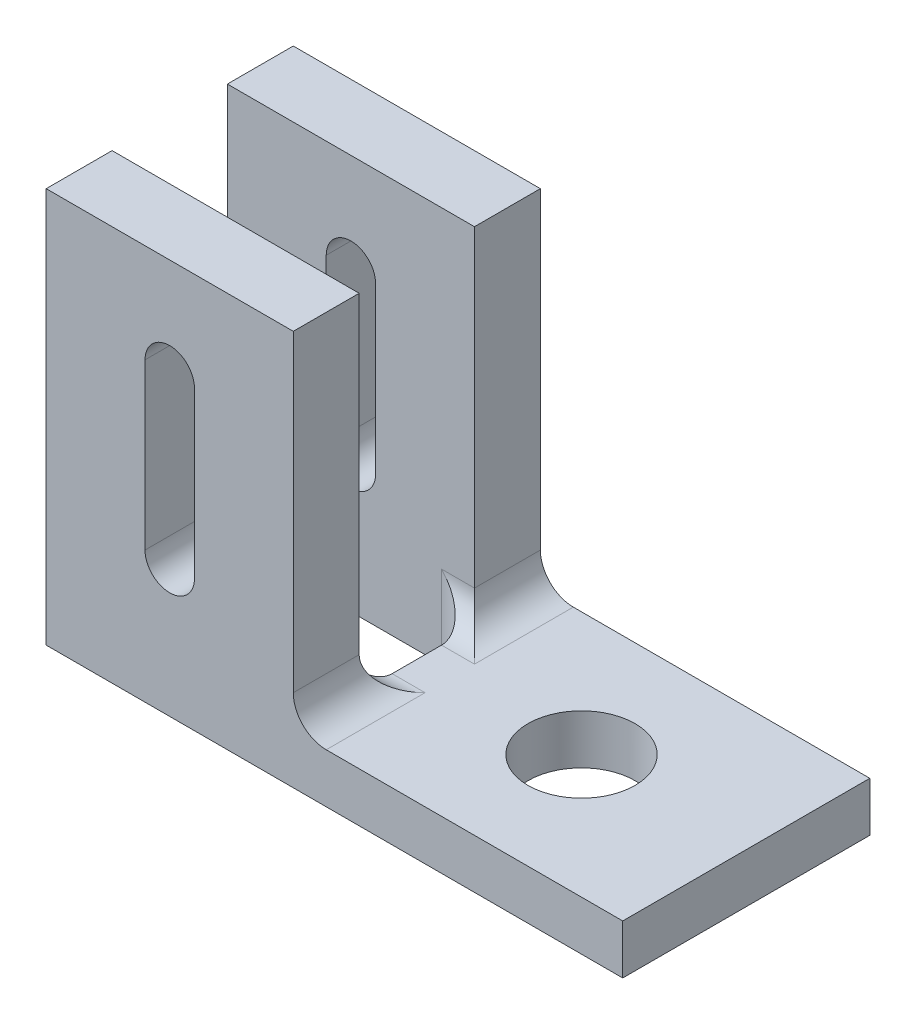
ISO-10303-21;
HEADER;
FILE_DESCRIPTION(('STEP AP214'),'2;1');
FILE_NAME('part.step','',(''),(''),'','','');
FILE_SCHEMA(('AUTOMOTIVE_DESIGN { 1 0 10303 214 1 1 1 1 }'));
ENDSEC;
DATA;
#1=APPLICATION_CONTEXT('core data for automotive mechanical design processes');
#2=APPLICATION_PROTOCOL_DEFINITION('international standard','automotive_design',2000,#1);
#3=PRODUCT_CONTEXT('',#1,'mechanical');
#4=PRODUCT('Part','Part','',(#3));
#5=PRODUCT_RELATED_PRODUCT_CATEGORY('part','',(#4));
#6=PRODUCT_DEFINITION_FORMATION('','',#4);
#7=PRODUCT_DEFINITION_CONTEXT('part definition',#1,'design');
#8=PRODUCT_DEFINITION('design','',#6,#7);
#9=PRODUCT_DEFINITION_SHAPE('','',#8);
#10=(LENGTH_UNIT() NAMED_UNIT(*) SI_UNIT(.MILLI.,.METRE.));
#11=(NAMED_UNIT(*) PLANE_ANGLE_UNIT() SI_UNIT($,.RADIAN.));
#12=(NAMED_UNIT(*) SI_UNIT($,.STERADIAN.) SOLID_ANGLE_UNIT());
#13=UNCERTAINTY_MEASURE_WITH_UNIT(LENGTH_MEASURE(1.E-05),#10,'distance_accuracy_value','');
#14=(GEOMETRIC_REPRESENTATION_CONTEXT(3) GLOBAL_UNCERTAINTY_ASSIGNED_CONTEXT((#13)) GLOBAL_UNIT_ASSIGNED_CONTEXT((#10,
#11,#12)) REPRESENTATION_CONTEXT('',''));
#15=CARTESIAN_POINT('',(0.,0.,0.));
#16=DIRECTION('',(0.,0.,1.));
#17=DIRECTION('',(1.,0.,0.));
#18=AXIS2_PLACEMENT_3D('',#15,#16,#17);
#19=CARTESIAN_POINT('',(-3.25798973217916,24.8389409904563,15.));
#20=DIRECTION('',(-1.,0.,0.));
#21=DIRECTION('',(0.,-1.,0.));
#22=AXIS2_PLACEMENT_3D('',#19,#20,#21);
#23=PLANE('',#22);
#24=DIRECTION('',(0.,1.,0.));
#25=VECTOR('',#24,1.);
#26=CARTESIAN_POINT('',(-3.25798973217916,24.8389409904563,15.));
#27=LINE('',#26,#25);
#28=CARTESIAN_POINT('',(-3.25798973217916,5.83894099045628,15.));
#29=VERTEX_POINT('',#28);
#30=CARTESIAN_POINT('',(-3.25798973217916,24.8389409904563,15.));
#31=VERTEX_POINT('',#30);
#32=EDGE_CURVE('E305',#29,#31,#27,.T.);
#33=ORIENTED_EDGE('',*,*,#32,.F.);
#34=DIRECTION('',(0.,0.,-1.));
#35=VECTOR('',#34,1.);
#36=CARTESIAN_POINT('',(-3.25798973217916,5.83894099045627,11.));
#37=LINE('',#36,#35);
#38=CARTESIAN_POINT('',(-3.25798973217916,5.83894099045627,11.));
#39=VERTEX_POINT('',#38);
#40=EDGE_CURVE('E273',#29,#39,#37,.T.);
#41=ORIENTED_EDGE('',*,*,#40,.T.);
#42=DIRECTION('',(0.,-1.,0.));
#43=VECTOR('',#42,1.);
#44=CARTESIAN_POINT('',(-3.25798973217917,24.8389409904563,11.));
#45=LINE('',#44,#43);
#46=CARTESIAN_POINT('',(-3.25798973217917,24.8389409904563,11.));
#47=VERTEX_POINT('',#46);
#48=EDGE_CURVE('E209',#47,#39,#45,.T.);
#49=ORIENTED_EDGE('',*,*,#48,.F.);
#50=DIRECTION('',(0.,0.,-1.));
#51=VECTOR('',#50,1.);
#52=CARTESIAN_POINT('',(-3.25798973217916,24.8389409904563,15.));
#53=LINE('',#52,#51);
#54=EDGE_CURVE('E225',#31,#47,#53,.T.);
#55=ORIENTED_EDGE('',*,*,#54,.F.);
#56=EDGE_LOOP('',(#33,#41,#49,#55));
#57=FACE_BOUND('',#56,.T.);
#58=ADVANCED_FACE('F35',(#57),#23,.F.);
#59=CARTESIAN_POINT('',(-18.2579897321792,24.8389409904563,15.));
#60=DIRECTION('',(0.,-1.,0.));
#61=DIRECTION('',(1.,0.,0.));
#62=AXIS2_PLACEMENT_3D('',#59,#60,#61);
#63=PLANE('',#62);
#64=ORIENTED_EDGE('',*,*,#54,.T.);
#65=DIRECTION('',(1.,0.,0.));
#66=VECTOR('',#65,1.);
#67=CARTESIAN_POINT('',(-18.2579897321792,24.8389409904563,11.));
#68=LINE('',#67,#66);
#69=CARTESIAN_POINT('',(-18.2579897321792,24.8389409904563,11.));
#70=VERTEX_POINT('',#69);
#71=EDGE_CURVE('E219',#70,#47,#68,.T.);
#72=ORIENTED_EDGE('',*,*,#71,.F.);
#73=DIRECTION('',(0.,0.,-1.));
#74=VECTOR('',#73,1.);
#75=CARTESIAN_POINT('',(-18.2579897321792,24.8389409904563,15.));
#76=LINE('',#75,#74);
#77=CARTESIAN_POINT('',(-18.2579897321792,24.8389409904563,15.));
#78=VERTEX_POINT('',#77);
#79=EDGE_CURVE('E226',#78,#70,#76,.T.);
#80=ORIENTED_EDGE('',*,*,#79,.F.);
#81=DIRECTION('',(-1.,0.,0.));
#82=VECTOR('',#81,1.);
#83=CARTESIAN_POINT('',(-18.2579897321792,24.8389409904563,15.));
#84=LINE('',#83,#82);
#85=EDGE_CURVE('E386',#31,#78,#84,.T.);
#86=ORIENTED_EDGE('',*,*,#85,.F.);
#87=EDGE_LOOP('',(#64,#72,#80,#86));
#88=FACE_BOUND('',#87,.T.);
#89=ADVANCED_FACE('F435',(#88),#63,.F.);
#90=CARTESIAN_POINT('',(-18.2579897321792,24.8389409904563,15.));
#91=DIRECTION('',(1.,0.,0.));
#92=DIRECTION('',(0.,1.,0.));
#93=AXIS2_PLACEMENT_3D('',#90,#91,#92);
#94=PLANE('',#93);
#95=DIRECTION('',(0.,0.,-1.));
#96=VECTOR('',#95,1.);
#97=CARTESIAN_POINT('',(-18.2579897321792,0.838940990456269,15.));
#98=LINE('',#97,#96);
#99=CARTESIAN_POINT('',(-18.2579897321792,0.838940990456269,4.));
#100=VERTEX_POINT('',#99);
#101=CARTESIAN_POINT('',(-18.2579897321792,0.838940990456269,0.));
#102=VERTEX_POINT('',#101);
#103=EDGE_CURVE('E239',#100,#102,#98,.T.);
#104=ORIENTED_EDGE('',*,*,#103,.F.);
#105=DIRECTION('',(0.,1.,0.));
#106=VECTOR('',#105,1.);
#107=CARTESIAN_POINT('',(-18.2579897321792,-12.1610590095437,4.));
#108=LINE('',#107,#106);
#109=CARTESIAN_POINT('',(-18.2579897321792,24.8389409904563,4.));
#110=VERTEX_POINT('',#109);
#111=EDGE_CURVE('E312',#100,#110,#108,.T.);
#112=ORIENTED_EDGE('',*,*,#111,.T.);
#113=CARTESIAN_POINT('',(-18.2579897321792,24.8389409904563,0.));
#114=VERTEX_POINT('',#113);
#115=EDGE_CURVE('E218',#110,#114,#76,.T.);
#116=ORIENTED_EDGE('',*,*,#115,.T.);
#117=DIRECTION('',(0.,-1.,0.));
#118=VECTOR('',#117,1.);
#119=CARTESIAN_POINT('',(-18.2579897321792,24.8389409904563,0.));
#120=LINE('',#119,#118);
#121=EDGE_CURVE('E373',#114,#102,#120,.T.);
#122=ORIENTED_EDGE('',*,*,#121,.T.);
#123=EDGE_LOOP('',(#104,#112,#116,#122));
#124=FACE_BOUND('',#123,.T.);
#125=ADVANCED_FACE('F405',(#124),#94,.F.);
#126=CARTESIAN_POINT('',(-10.7579897321792,18.8389409904563,15.));
#127=DIRECTION('',(0.,0.,-1.));
#128=DIRECTION('',(-1.,0.,0.));
#129=AXIS2_PLACEMENT_3D('',#126,#127,#128);
#130=CYLINDRICAL_SURFACE('',#129,1.5);
#131=CARTESIAN_POINT('',(-10.7579897321792,18.8389409904563,4.));
#132=DIRECTION('',(0.,0.,-1.));
#133=DIRECTION('',(-1.,0.,0.));
#134=AXIS2_PLACEMENT_3D('',#131,#132,#133);
#135=CIRCLE('',#134,1.5);
#136=CARTESIAN_POINT('',(-12.2579897321792,18.8389409904563,4.));
#137=VERTEX_POINT('',#136);
#138=CARTESIAN_POINT('',(-9.25798973217916,18.8389409904563,4.));
#139=VERTEX_POINT('',#138);
#140=EDGE_CURVE('E331',#137,#139,#135,.T.);
#141=ORIENTED_EDGE('',*,*,#140,.F.);
#142=DIRECTION('',(0.,0.,-1.));
#143=VECTOR('',#142,1.);
#144=CARTESIAN_POINT('',(-12.2579897321792,18.8389409904563,15.));
#145=LINE('',#144,#143);
#146=CARTESIAN_POINT('',(-12.2579897321792,18.8389409904563,0.));
#147=VERTEX_POINT('',#146);
#148=EDGE_CURVE('E369',#137,#147,#145,.T.);
#149=ORIENTED_EDGE('',*,*,#148,.T.);
#150=CARTESIAN_POINT('',(-10.7579897321792,18.8389409904563,0.));
#151=DIRECTION('',(0.,0.,1.));
#152=DIRECTION('',(1.,0.,0.));
#153=AXIS2_PLACEMENT_3D('',#150,#151,#152);
#154=CIRCLE('',#153,1.5);
#155=CARTESIAN_POINT('',(-9.25798973217916,18.8389409904563,0.));
#156=VERTEX_POINT('',#155);
#157=EDGE_CURVE('E336',#156,#147,#154,.T.);
#158=ORIENTED_EDGE('',*,*,#157,.F.);
#159=DIRECTION('',(0.,0.,-1.));
#160=VECTOR('',#159,1.);
#161=CARTESIAN_POINT('',(-9.25798973217916,18.8389409904563,15.));
#162=LINE('',#161,#160);
#163=EDGE_CURVE('E347',#139,#156,#162,.T.);
#164=ORIENTED_EDGE('',*,*,#163,.F.);
#165=EDGE_LOOP('',(#141,#149,#158,#164));
#166=FACE_BOUND('',#165,.T.);
#167=ADVANCED_FACE('F442',(#166),#130,.F.);
#168=CARTESIAN_POINT('',(-12.2579897321792,18.8389409904563,15.));
#169=DIRECTION('',(1.,0.,0.));
#170=DIRECTION('',(0.,1.,0.));
#171=AXIS2_PLACEMENT_3D('',#168,#169,#170);
#172=PLANE('',#171);
#173=DIRECTION('',(0.,1.,0.));
#174=VECTOR('',#173,1.);
#175=CARTESIAN_POINT('',(-12.2579897321792,18.8389409904563,4.));
#176=LINE('',#175,#174);
#177=CARTESIAN_POINT('',(-12.2579897321792,8.83894099045627,4.));
#178=VERTEX_POINT('',#177);
#179=EDGE_CURVE('E329',#178,#137,#176,.T.);
#180=ORIENTED_EDGE('',*,*,#179,.F.);
#181=DIRECTION('',(0.,0.,-1.));
#182=VECTOR('',#181,1.);
#183=CARTESIAN_POINT('',(-12.2579897321792,8.83894099045627,15.));
#184=LINE('',#183,#182);
#185=CARTESIAN_POINT('',(-12.2579897321792,8.83894099045627,0.));
#186=VERTEX_POINT('',#185);
#187=EDGE_CURVE('E365',#178,#186,#184,.T.);
#188=ORIENTED_EDGE('',*,*,#187,.T.);
#189=DIRECTION('',(0.,-1.,0.));
#190=VECTOR('',#189,1.);
#191=CARTESIAN_POINT('',(-12.2579897321792,18.8389409904563,0.));
#192=LINE('',#191,#190);
#193=EDGE_CURVE('E350',#147,#186,#192,.T.);
#194=ORIENTED_EDGE('',*,*,#193,.F.);
#195=ORIENTED_EDGE('',*,*,#148,.F.);
#196=EDGE_LOOP('',(#180,#188,#194,#195));
#197=FACE_BOUND('',#196,.T.);
#198=ADVANCED_FACE('F551',(#197),#172,.T.);
#199=CARTESIAN_POINT('',(-10.7579897321792,8.83894099045627,15.));
#200=DIRECTION('',(0.,0.,-1.));
#201=DIRECTION('',(-1.,0.,0.));
#202=AXIS2_PLACEMENT_3D('',#199,#200,#201);
#203=CYLINDRICAL_SURFACE('',#202,1.5);
#204=CARTESIAN_POINT('',(-10.7579897321792,8.83894099045627,4.));
#205=DIRECTION('',(0.,0.,-1.));
#206=DIRECTION('',(-1.,0.,0.));
#207=AXIS2_PLACEMENT_3D('',#204,#205,#206);
#208=CIRCLE('',#207,1.5);
#209=CARTESIAN_POINT('',(-9.25798973217916,8.83894099045627,4.));
#210=VERTEX_POINT('',#209);
#211=EDGE_CURVE('E327',#210,#178,#208,.T.);
#212=ORIENTED_EDGE('',*,*,#211,.F.);
#213=DIRECTION('',(0.,0.,-1.));
#214=VECTOR('',#213,1.);
#215=CARTESIAN_POINT('',(-9.25798973217916,8.83894099045627,15.));
#216=LINE('',#215,#214);
#217=CARTESIAN_POINT('',(-9.25798973217916,8.83894099045627,0.));
#218=VERTEX_POINT('',#217);
#219=EDGE_CURVE('E361',#210,#218,#216,.T.);
#220=ORIENTED_EDGE('',*,*,#219,.T.);
#221=CARTESIAN_POINT('',(-10.7579897321792,8.83894099045627,0.));
#222=DIRECTION('',(0.,0.,1.));
#223=DIRECTION('',(1.,0.,0.));
#224=AXIS2_PLACEMENT_3D('',#221,#222,#223);
#225=CIRCLE('',#224,1.5);
#226=EDGE_CURVE('E353',#186,#218,#225,.T.);
#227=ORIENTED_EDGE('',*,*,#226,.F.);
#228=ORIENTED_EDGE('',*,*,#187,.F.);
#229=EDGE_LOOP('',(#212,#220,#227,#228));
#230=FACE_BOUND('',#229,.T.);
#231=ADVANCED_FACE('F544',(#230),#203,.F.);
#232=CARTESIAN_POINT('',(-9.25798973217916,8.83894099045627,15.));
#233=DIRECTION('',(-1.,0.,0.));
#234=DIRECTION('',(0.,0.,1.));
#235=AXIS2_PLACEMENT_3D('',#232,#233,#234);
#236=PLANE('',#235);
#237=DIRECTION('',(0.,-1.,0.));
#238=VECTOR('',#237,1.);
#239=CARTESIAN_POINT('',(-9.25798973217916,8.83894099045627,4.));
#240=LINE('',#239,#238);
#241=EDGE_CURVE('E245',#139,#210,#240,.T.);
#242=ORIENTED_EDGE('',*,*,#241,.F.);
#243=ORIENTED_EDGE('',*,*,#163,.T.);
#244=DIRECTION('',(0.,1.,0.));
#245=VECTOR('',#244,1.);
#246=CARTESIAN_POINT('',(-9.25798973217916,8.83894099045627,0.));
#247=LINE('',#246,#245);
#248=EDGE_CURVE('E340',#218,#156,#247,.T.);
#249=ORIENTED_EDGE('',*,*,#248,.F.);
#250=ORIENTED_EDGE('',*,*,#219,.F.);
#251=EDGE_LOOP('',(#242,#243,#249,#250));
#252=FACE_BOUND('',#251,.T.);
#253=ADVANCED_FACE('F536',(#252),#236,.T.);
#254=CARTESIAN_POINT('',(0.,0.,15.));
#255=DIRECTION('',(0.,0.,1.));
#256=DIRECTION('',(1.,0.,0.));
#257=AXIS2_PLACEMENT_3D('',#254,#255,#256);
#258=PLANE('',#257);
#259=DIRECTION('',(0.,-1.,0.));
#260=VECTOR('',#259,1.);
#261=CARTESIAN_POINT('',(-18.2579897321792,24.8389409904563,15.));
#262=LINE('',#261,#260);
#263=CARTESIAN_POINT('',(-18.2579897321792,0.838940990456269,15.));
#264=VERTEX_POINT('',#263);
#265=EDGE_CURVE('E374',#78,#264,#262,.T.);
#266=ORIENTED_EDGE('',*,*,#265,.T.);
#267=DIRECTION('',(1.,0.,0.));
#268=VECTOR('',#267,1.);
#269=CARTESIAN_POINT('',(-18.2579897321792,0.838940990456269,15.));
#270=LINE('',#269,#268);
#271=CARTESIAN_POINT('',(16.7420102678208,0.838940990456276,15.));
#272=VERTEX_POINT('',#271);
#273=EDGE_CURVE('E377',#264,#272,#270,.T.);
#274=ORIENTED_EDGE('',*,*,#273,.T.);
#275=DIRECTION('',(0.,1.,0.));
#276=VECTOR('',#275,1.);
#277=CARTESIAN_POINT('',(16.7420102678208,3.83894099045628,15.));
#278=LINE('',#277,#276);
#279=CARTESIAN_POINT('',(16.7420102678208,3.83894099045628,15.));
#280=VERTEX_POINT('',#279);
#281=EDGE_CURVE('E380',#272,#280,#278,.T.);
#282=ORIENTED_EDGE('',*,*,#281,.T.);
#283=DIRECTION('',(-1.,0.,0.));
#284=VECTOR('',#283,1.);
#285=CARTESIAN_POINT('',(-3.25798973217916,3.83894099045627,15.));
#286=LINE('',#285,#284);
#287=CARTESIAN_POINT('',(-1.25798973217916,3.83894099045627,15.));
#288=VERTEX_POINT('',#287);
#289=EDGE_CURVE('E382',#280,#288,#286,.T.);
#290=ORIENTED_EDGE('',*,*,#289,.T.);
#291=CARTESIAN_POINT('',(-1.25798973217916,5.83894099045627,15.));
#292=DIRECTION('',(0.,0.,1.));
#293=DIRECTION('',(1.,0.,0.));
#294=AXIS2_PLACEMENT_3D('',#291,#292,#293);
#295=CIRCLE('',#294,2.);
#296=EDGE_CURVE('E281',#288,#29,#295,.F.);
#297=ORIENTED_EDGE('',*,*,#296,.T.);
#298=ORIENTED_EDGE('',*,*,#32,.T.);
#299=ORIENTED_EDGE('',*,*,#85,.T.);
#300=EDGE_LOOP('',(#266,#274,#282,#290,#297,#298,#299));
#301=FACE_BOUND('',#300,.T.);
#302=DIRECTION('',(0.,-1.,0.));
#303=VECTOR('',#302,1.);
#304=CARTESIAN_POINT('',(-12.2579897321792,18.8389409904563,15.));
#305=LINE('',#304,#303);
#306=CARTESIAN_POINT('',(-12.2579897321792,18.8389409904563,15.));
#307=VERTEX_POINT('',#306);
#308=CARTESIAN_POINT('',(-12.2579897321792,8.83894099045627,15.));
#309=VERTEX_POINT('',#308);
#310=EDGE_CURVE('E339',#307,#309,#305,.T.);
#311=ORIENTED_EDGE('',*,*,#310,.F.);
#312=CARTESIAN_POINT('',(-10.7579897321792,18.8389409904563,15.));
#313=DIRECTION('',(0.,0.,1.));
#314=DIRECTION('',(1.,0.,0.));
#315=AXIS2_PLACEMENT_3D('',#312,#313,#314);
#316=CIRCLE('',#315,1.5);
#317=CARTESIAN_POINT('',(-9.25798973217916,18.8389409904563,15.));
#318=VERTEX_POINT('',#317);
#319=EDGE_CURVE('E337',#318,#307,#316,.T.);
#320=ORIENTED_EDGE('',*,*,#319,.F.);
#321=DIRECTION('',(0.,1.,0.));
#322=VECTOR('',#321,1.);
#323=CARTESIAN_POINT('',(-9.25798973217916,8.83894099045627,15.));
#324=LINE('',#323,#322);
#325=CARTESIAN_POINT('',(-9.25798973217916,8.83894099045627,15.));
#326=VERTEX_POINT('',#325);
#327=EDGE_CURVE('E345',#326,#318,#324,.T.);
#328=ORIENTED_EDGE('',*,*,#327,.F.);
#329=CARTESIAN_POINT('',(-10.7579897321792,8.83894099045627,15.));
#330=DIRECTION('',(0.,0.,1.));
#331=DIRECTION('',(1.,0.,0.));
#332=AXIS2_PLACEMENT_3D('',#329,#330,#331);
#333=CIRCLE('',#332,1.5);
#334=EDGE_CURVE('E342',#309,#326,#333,.T.);
#335=ORIENTED_EDGE('',*,*,#334,.F.);
#336=EDGE_LOOP('',(#311,#320,#328,#335));
#337=FACE_BOUND('',#336,.T.);
#338=ADVANCED_FACE('F430',(#301,#337),#258,.T.);
#339=CARTESIAN_POINT('',(0.,0.,0.));
#340=DIRECTION('',(0.,0.,1.));
#341=DIRECTION('',(1.,0.,0.));
#342=AXIS2_PLACEMENT_3D('',#339,#340,#341);
#343=PLANE('',#342);
#344=ORIENTED_EDGE('',*,*,#121,.F.);
#345=DIRECTION('',(-1.,0.,0.));
#346=VECTOR('',#345,1.);
#347=CARTESIAN_POINT('',(-18.2579897321792,24.8389409904563,0.));
#348=LINE('',#347,#346);
#349=CARTESIAN_POINT('',(-3.25798973217916,24.8389409904563,0.));
#350=VERTEX_POINT('',#349);
#351=EDGE_CURVE('E378',#350,#114,#348,.T.);
#352=ORIENTED_EDGE('',*,*,#351,.F.);
#353=DIRECTION('',(0.,1.,0.));
#354=VECTOR('',#353,1.);
#355=CARTESIAN_POINT('',(-3.25798973217916,24.8389409904563,0.));
#356=LINE('',#355,#354);
#357=CARTESIAN_POINT('',(-3.25798973217916,5.83894099045628,0.));
#358=VERTEX_POINT('',#357);
#359=EDGE_CURVE('E224',#358,#350,#356,.T.);
#360=ORIENTED_EDGE('',*,*,#359,.F.);
#361=CARTESIAN_POINT('',(-1.25798973217916,5.83894099045627,0.));
#362=DIRECTION('',(0.,0.,1.));
#363=DIRECTION('',(1.,0.,0.));
#364=AXIS2_PLACEMENT_3D('',#361,#362,#363);
#365=CIRCLE('',#364,2.);
#366=CARTESIAN_POINT('',(-1.25798973217916,3.83894099045627,0.));
#367=VERTEX_POINT('',#366);
#368=EDGE_CURVE('E279',#358,#367,#365,.T.);
#369=ORIENTED_EDGE('',*,*,#368,.T.);
#370=DIRECTION('',(-1.,0.,0.));
#371=VECTOR('',#370,1.);
#372=CARTESIAN_POINT('',(-3.25798973217916,3.83894099045627,0.));
#373=LINE('',#372,#371);
#374=CARTESIAN_POINT('',(16.7420102678208,3.83894099045628,0.));
#375=VERTEX_POINT('',#374);
#376=EDGE_CURVE('E394',#375,#367,#373,.T.);
#377=ORIENTED_EDGE('',*,*,#376,.F.);
#378=DIRECTION('',(0.,1.,0.));
#379=VECTOR('',#378,1.);
#380=CARTESIAN_POINT('',(16.7420102678208,3.83894099045628,0.));
#381=LINE('',#380,#379);
#382=CARTESIAN_POINT('',(16.7420102678208,0.838940990456276,0.));
#383=VERTEX_POINT('',#382);
#384=EDGE_CURVE('E392',#383,#375,#381,.T.);
#385=ORIENTED_EDGE('',*,*,#384,.F.);
#386=DIRECTION('',(1.,0.,0.));
#387=VECTOR('',#386,1.);
#388=CARTESIAN_POINT('',(-18.2579897321792,0.838940990456269,0.));
#389=LINE('',#388,#387);
#390=EDGE_CURVE('E390',#102,#383,#389,.T.);
#391=ORIENTED_EDGE('',*,*,#390,.F.);
#392=EDGE_LOOP('',(#344,#352,#360,#369,#377,#385,#391));
#393=FACE_BOUND('',#392,.T.);
#394=ORIENTED_EDGE('',*,*,#157,.T.);
#395=ORIENTED_EDGE('',*,*,#193,.T.);
#396=ORIENTED_EDGE('',*,*,#226,.T.);
#397=ORIENTED_EDGE('',*,*,#248,.T.);
#398=EDGE_LOOP('',(#394,#395,#396,#397));
#399=FACE_BOUND('',#398,.T.);
#400=ADVANCED_FACE('F400',(#393,#399),#343,.F.);
#401=ORIENTED_EDGE('',*,*,#79,.T.);
#402=DIRECTION('',(0.,1.,0.));
#403=VECTOR('',#402,1.);
#404=CARTESIAN_POINT('',(-18.2579897321792,-12.1610590095437,11.));
#405=LINE('',#404,#403);
#406=CARTESIAN_POINT('',(-18.2579897321792,0.838940990456269,11.));
#407=VERTEX_POINT('',#406);
#408=EDGE_CURVE('E309',#407,#70,#405,.T.);
#409=ORIENTED_EDGE('',*,*,#408,.F.);
#410=EDGE_CURVE('E240',#264,#407,#98,.T.);
#411=ORIENTED_EDGE('',*,*,#410,.F.);
#412=ORIENTED_EDGE('',*,*,#265,.F.);
#413=EDGE_LOOP('',(#401,#409,#411,#412));
#414=FACE_BOUND('',#413,.T.);
#415=ADVANCED_FACE('F434',(#414),#94,.F.);
#416=CARTESIAN_POINT('',(-18.2579897321792,0.838940990456269,15.));
#417=DIRECTION('',(0.,1.,0.));
#418=DIRECTION('',(-1.,0.,0.));
#419=AXIS2_PLACEMENT_3D('',#416,#417,#418);
#420=PLANE('',#419);
#421=DIRECTION('',(1.,0.,0.));
#422=VECTOR('',#421,1.);
#423=CARTESIAN_POINT('',(-18.2579897321792,0.838940990456269,11.));
#424=LINE('',#423,#422);
#425=CARTESIAN_POINT('',(-5.25798973217916,0.838940990456271,11.));
#426=VERTEX_POINT('',#425);
#427=EDGE_CURVE('E324',#407,#426,#424,.T.);
#428=ORIENTED_EDGE('',*,*,#427,.T.);
#429=CARTESIAN_POINT('',(-5.25798973217916,0.838940990456271,9.));
#430=DIRECTION('',(0.,1.,0.));
#431=DIRECTION('',(-1.,0.,0.));
#432=AXIS2_PLACEMENT_3D('',#429,#430,#431);
#433=CIRCLE('',#432,2.);
#434=CARTESIAN_POINT('',(-3.25798973217916,0.838940990456272,9.));
#435=VERTEX_POINT('',#434);
#436=EDGE_CURVE('E261',#426,#435,#433,.T.);
#437=ORIENTED_EDGE('',*,*,#436,.T.);
#438=DIRECTION('',(0.,0.,-1.));
#439=VECTOR('',#438,1.);
#440=CARTESIAN_POINT('',(-3.25798973217916,0.838940990456272,15.));
#441=LINE('',#440,#439);
#442=CARTESIAN_POINT('',(-3.25798973217916,0.838940990456272,6.));
#443=VERTEX_POINT('',#442);
#444=EDGE_CURVE('E220',#435,#443,#441,.T.);
#445=ORIENTED_EDGE('',*,*,#444,.T.);
#446=CARTESIAN_POINT('',(-5.25798973217916,0.838940990456271,6.));
#447=DIRECTION('',(0.,1.,0.));
#448=DIRECTION('',(-1.,0.,0.));
#449=AXIS2_PLACEMENT_3D('',#446,#447,#448);
#450=CIRCLE('',#449,2.);
#451=CARTESIAN_POINT('',(-5.25798973217916,0.838940990456271,4.));
#452=VERTEX_POINT('',#451);
#453=EDGE_CURVE('E259',#443,#452,#450,.T.);
#454=ORIENTED_EDGE('',*,*,#453,.T.);
#455=DIRECTION('',(-1.,0.,0.));
#456=VECTOR('',#455,1.);
#457=CARTESIAN_POINT('',(-18.2579897321792,0.838940990456269,4.));
#458=LINE('',#457,#456);
#459=EDGE_CURVE('E251',#452,#100,#458,.T.);
#460=ORIENTED_EDGE('',*,*,#459,.T.);
#461=ORIENTED_EDGE('',*,*,#103,.T.);
#462=ORIENTED_EDGE('',*,*,#390,.T.);
#463=DIRECTION('',(0.,0.,-1.));
#464=VECTOR('',#463,1.);
#465=CARTESIAN_POINT('',(16.7420102678208,0.838940990456276,15.));
#466=LINE('',#465,#464);
#467=EDGE_CURVE('E236',#272,#383,#466,.T.);
#468=ORIENTED_EDGE('',*,*,#467,.F.);
#469=ORIENTED_EDGE('',*,*,#273,.F.);
#470=ORIENTED_EDGE('',*,*,#410,.T.);
#471=EDGE_LOOP('',(#428,#437,#445,#454,#460,#461,#462,#468,#469,#470));
#472=FACE_BOUND('',#471,.T.);
#473=CARTESIAN_POINT('',(6.74201026782085,0.838940990456274,7.5));
#474=DIRECTION('',(0.,1.,0.));
#475=DIRECTION('',(-1.,0.,0.));
#476=AXIS2_PLACEMENT_3D('',#473,#474,#475);
#477=CIRCLE('',#476,3.25);
#478=CARTESIAN_POINT('',(3.49201026782084,0.838940990456273,7.5));
#479=VERTEX_POINT('',#478);
#480=EDGE_CURVE('E250',#479,#479,#477,.T.);
#481=ORIENTED_EDGE('',*,*,#480,.T.);
#482=EDGE_LOOP('',(#481));
#483=FACE_BOUND('',#482,.T.);
#484=ADVANCED_FACE('F425',(#472,#483),#420,.F.);
#485=CARTESIAN_POINT('',(16.7420102678208,3.83894099045628,15.));
#486=DIRECTION('',(-1.,0.,0.));
#487=DIRECTION('',(0.,0.,1.));
#488=AXIS2_PLACEMENT_3D('',#485,#486,#487);
#489=PLANE('',#488);
#490=ORIENTED_EDGE('',*,*,#384,.T.);
#491=DIRECTION('',(0.,0.,-1.));
#492=VECTOR('',#491,1.);
#493=CARTESIAN_POINT('',(16.7420102678208,3.83894099045628,15.));
#494=LINE('',#493,#492);
#495=EDGE_CURVE('E229',#280,#375,#494,.T.);
#496=ORIENTED_EDGE('',*,*,#495,.F.);
#497=ORIENTED_EDGE('',*,*,#281,.F.);
#498=ORIENTED_EDGE('',*,*,#467,.T.);
#499=EDGE_LOOP('',(#490,#496,#497,#498));
#500=FACE_BOUND('',#499,.T.);
#501=ADVANCED_FACE('F423',(#500),#489,.F.);
#502=CARTESIAN_POINT('',(-3.25798973217916,3.83894099045627,15.));
#503=DIRECTION('',(0.,-1.,0.));
#504=DIRECTION('',(1.,0.,0.));
#505=AXIS2_PLACEMENT_3D('',#502,#503,#504);
#506=PLANE('',#505);
#507=CARTESIAN_POINT('',(6.74201026782084,3.83894099045628,7.5));
#508=DIRECTION('',(0.,-1.,0.));
#509=DIRECTION('',(1.,0.,0.));
#510=AXIS2_PLACEMENT_3D('',#507,#508,#509);
#511=CIRCLE('',#510,3.25);
#512=CARTESIAN_POINT('',(9.99201026782085,3.83894099045628,7.5));
#513=VERTEX_POINT('',#512);
#514=EDGE_CURVE('E247',#513,#513,#511,.T.);
#515=ORIENTED_EDGE('',*,*,#514,.T.);
#516=EDGE_LOOP('',(#515));
#517=FACE_BOUND('',#516,.T.);
#518=DIRECTION('',(-1.,0.,0.));
#519=VECTOR('',#518,1.);
#520=CARTESIAN_POINT('',(-3.25798973217916,3.83894099045627,9.));
#521=LINE('',#520,#519);
#522=CARTESIAN_POINT('',(-3.25798973217916,3.83894099045627,9.));
#523=VERTEX_POINT('',#522);
#524=CARTESIAN_POINT('',(-1.25798973217916,3.83894099045627,9.));
#525=VERTEX_POINT('',#524);
#526=EDGE_CURVE('E269',#523,#525,#521,.F.);
#527=ORIENTED_EDGE('',*,*,#526,.T.);
#528=DIRECTION('',(0.,0.,-1.));
#529=VECTOR('',#528,1.);
#530=CARTESIAN_POINT('',(-1.25798973217916,3.83894099045627,15.));
#531=LINE('',#530,#529);
#532=EDGE_CURVE('E271',#525,#288,#531,.F.);
#533=ORIENTED_EDGE('',*,*,#532,.T.);
#534=ORIENTED_EDGE('',*,*,#289,.F.);
#535=ORIENTED_EDGE('',*,*,#495,.T.);
#536=ORIENTED_EDGE('',*,*,#376,.T.);
#537=DIRECTION('',(0.,0.,-1.));
#538=VECTOR('',#537,1.);
#539=CARTESIAN_POINT('',(-1.25798973217916,3.83894099045627,4.));
#540=LINE('',#539,#538);
#541=CARTESIAN_POINT('',(-1.25798973217916,3.83894099045627,6.));
#542=VERTEX_POINT('',#541);
#543=EDGE_CURVE('E267',#367,#542,#540,.F.);
#544=ORIENTED_EDGE('',*,*,#543,.T.);
#545=DIRECTION('',(1.,0.,0.));
#546=VECTOR('',#545,1.);
#547=CARTESIAN_POINT('',(-5.25798973217916,3.83894099045627,6.));
#548=LINE('',#547,#546);
#549=CARTESIAN_POINT('',(-3.25798973217916,3.83894099045627,6.));
#550=VERTEX_POINT('',#549);
#551=EDGE_CURVE('E265',#542,#550,#548,.F.);
#552=ORIENTED_EDGE('',*,*,#551,.T.);
#553=DIRECTION('',(0.,0.,1.));
#554=VECTOR('',#553,1.);
#555=CARTESIAN_POINT('',(-3.25798973217916,3.83894099045627,15.));
#556=LINE('',#555,#554);
#557=EDGE_CURVE('E208',#550,#523,#556,.T.);
#558=ORIENTED_EDGE('',*,*,#557,.T.);
#559=EDGE_LOOP('',(#527,#533,#534,#535,#536,#544,#552,#558));
#560=FACE_BOUND('',#559,.T.);
#561=ADVANCED_FACE('F418',(#517,#560),#506,.F.);
#562=DIRECTION('',(0.,1.,0.));
#563=VECTOR('',#562,1.);
#564=CARTESIAN_POINT('',(-3.25798973217917,24.8389409904563,4.));
#565=LINE('',#564,#563);
#566=CARTESIAN_POINT('',(-3.25798973217916,5.83894099045627,4.));
#567=VERTEX_POINT('',#566);
#568=CARTESIAN_POINT('',(-3.25798973217917,24.8389409904563,4.));
#569=VERTEX_POINT('',#568);
#570=EDGE_CURVE('E196',#567,#569,#565,.T.);
#571=ORIENTED_EDGE('',*,*,#570,.F.);
#572=DIRECTION('',(0.,0.,-1.));
#573=VECTOR('',#572,1.);
#574=CARTESIAN_POINT('',(-3.25798973217916,5.83894099045627,0.));
#575=LINE('',#574,#573);
#576=EDGE_CURVE('E263',#567,#358,#575,.T.);
#577=ORIENTED_EDGE('',*,*,#576,.T.);
#578=ORIENTED_EDGE('',*,*,#359,.T.);
#579=EDGE_CURVE('E216',#569,#350,#53,.T.);
#580=ORIENTED_EDGE('',*,*,#579,.F.);
#581=EDGE_LOOP('',(#571,#577,#578,#580));
#582=FACE_BOUND('',#581,.T.);
#583=ADVANCED_FACE('F222',(#582),#23,.F.);
#584=DIRECTION('',(-1.,0.,0.));
#585=VECTOR('',#584,1.);
#586=CARTESIAN_POINT('',(-8.25798973217916,24.8389409904563,4.));
#587=LINE('',#586,#585);
#588=EDGE_CURVE('E200',#569,#110,#587,.T.);
#589=ORIENTED_EDGE('',*,*,#588,.F.);
#590=ORIENTED_EDGE('',*,*,#579,.T.);
#591=ORIENTED_EDGE('',*,*,#351,.T.);
#592=ORIENTED_EDGE('',*,*,#115,.F.);
#593=EDGE_LOOP('',(#589,#590,#591,#592));
#594=FACE_BOUND('',#593,.T.);
#595=ADVANCED_FACE('F214',(#594),#63,.F.);
#596=CARTESIAN_POINT('',(-10.7579897321792,18.8389409904563,11.));
#597=DIRECTION('',(0.,0.,1.));
#598=DIRECTION('',(1.,0.,0.));
#599=AXIS2_PLACEMENT_3D('',#596,#597,#598);
#600=CIRCLE('',#599,1.5);
#601=CARTESIAN_POINT('',(-9.25798973217916,18.8389409904563,11.));
#602=VERTEX_POINT('',#601);
#603=CARTESIAN_POINT('',(-12.2579897321792,18.8389409904563,11.));
#604=VERTEX_POINT('',#603);
#605=EDGE_CURVE('E322',#602,#604,#600,.T.);
#606=ORIENTED_EDGE('',*,*,#605,.F.);
#607=EDGE_CURVE('E358',#318,#602,#162,.T.);
#608=ORIENTED_EDGE('',*,*,#607,.F.);
#609=ORIENTED_EDGE('',*,*,#319,.T.);
#610=EDGE_CURVE('E370',#307,#604,#145,.T.);
#611=ORIENTED_EDGE('',*,*,#610,.T.);
#612=EDGE_LOOP('',(#606,#608,#609,#611));
#613=FACE_BOUND('',#612,.T.);
#614=ADVANCED_FACE('F447',(#613),#130,.F.);
#615=DIRECTION('',(0.,-1.,0.));
#616=VECTOR('',#615,1.);
#617=CARTESIAN_POINT('',(-12.2579897321792,18.8389409904563,11.));
#618=LINE('',#617,#616);
#619=CARTESIAN_POINT('',(-12.2579897321792,8.83894099045627,11.));
#620=VERTEX_POINT('',#619);
#621=EDGE_CURVE('E320',#604,#620,#618,.T.);
#622=ORIENTED_EDGE('',*,*,#621,.F.);
#623=ORIENTED_EDGE('',*,*,#610,.F.);
#624=ORIENTED_EDGE('',*,*,#310,.T.);
#625=EDGE_CURVE('E366',#309,#620,#184,.T.);
#626=ORIENTED_EDGE('',*,*,#625,.T.);
#627=EDGE_LOOP('',(#622,#623,#624,#626));
#628=FACE_BOUND('',#627,.T.);
#629=ADVANCED_FACE('F452',(#628),#172,.T.);
#630=CARTESIAN_POINT('',(-10.7579897321792,8.83894099045627,11.));
#631=DIRECTION('',(0.,0.,1.));
#632=DIRECTION('',(1.,0.,0.));
#633=AXIS2_PLACEMENT_3D('',#630,#631,#632);
#634=CIRCLE('',#633,1.5);
#635=CARTESIAN_POINT('',(-9.25798973217916,8.83894099045627,11.));
#636=VERTEX_POINT('',#635);
#637=EDGE_CURVE('E317',#620,#636,#634,.T.);
#638=ORIENTED_EDGE('',*,*,#637,.F.);
#639=ORIENTED_EDGE('',*,*,#625,.F.);
#640=ORIENTED_EDGE('',*,*,#334,.T.);
#641=EDGE_CURVE('E362',#326,#636,#216,.T.);
#642=ORIENTED_EDGE('',*,*,#641,.T.);
#643=EDGE_LOOP('',(#638,#639,#640,#642));
#644=FACE_BOUND('',#643,.T.);
#645=ADVANCED_FACE('F533',(#644),#203,.F.);
#646=DIRECTION('',(0.,1.,0.));
#647=VECTOR('',#646,1.);
#648=CARTESIAN_POINT('',(-9.25798973217916,8.83894099045627,11.));
#649=LINE('',#648,#647);
#650=EDGE_CURVE('E243',#636,#602,#649,.T.);
#651=ORIENTED_EDGE('',*,*,#650,.F.);
#652=ORIENTED_EDGE('',*,*,#641,.F.);
#653=ORIENTED_EDGE('',*,*,#327,.T.);
#654=ORIENTED_EDGE('',*,*,#607,.T.);
#655=EDGE_LOOP('',(#651,#652,#653,#654));
#656=FACE_BOUND('',#655,.T.);
#657=ADVANCED_FACE('F526',(#656),#236,.T.);
#658=CARTESIAN_POINT('',(-8.25798973217915,-12.1610590095437,4.));
#659=DIRECTION('',(0.,0.,-1.));
#660=DIRECTION('',(-1.,0.,0.));
#661=AXIS2_PLACEMENT_3D('',#658,#659,#660);
#662=PLANE('',#661);
#663=ORIENTED_EDGE('',*,*,#140,.T.);
#664=ORIENTED_EDGE('',*,*,#241,.T.);
#665=ORIENTED_EDGE('',*,*,#211,.T.);
#666=ORIENTED_EDGE('',*,*,#179,.T.);
#667=EDGE_LOOP('',(#663,#664,#665,#666));
#668=FACE_BOUND('',#667,.T.);
#669=DIRECTION('',(0.,1.,0.));
#670=VECTOR('',#669,1.);
#671=CARTESIAN_POINT('',(-5.25798973217916,3.83894099045628,4.));
#672=LINE('',#671,#670);
#673=CARTESIAN_POINT('',(-5.25798973217916,5.83894099045627,4.));
#674=VERTEX_POINT('',#673);
#675=EDGE_CURVE('E52',#452,#674,#672,.T.);
#676=ORIENTED_EDGE('',*,*,#675,.T.);
#677=DIRECTION('',(1.,0.,0.));
#678=VECTOR('',#677,1.);
#679=CARTESIAN_POINT('',(-3.25798973217916,5.83894099045627,4.));
#680=LINE('',#679,#678);
#681=EDGE_CURVE('E203',#674,#567,#680,.T.);
#682=ORIENTED_EDGE('',*,*,#681,.T.);
#683=ORIENTED_EDGE('',*,*,#570,.T.);
#684=ORIENTED_EDGE('',*,*,#588,.T.);
#685=ORIENTED_EDGE('',*,*,#111,.F.);
#686=ORIENTED_EDGE('',*,*,#459,.F.);
#687=EDGE_LOOP('',(#676,#682,#683,#684,#685,#686));
#688=FACE_BOUND('',#687,.T.);
#689=ADVANCED_FACE('F198',(#668,#688),#662,.F.);
#690=CARTESIAN_POINT('',(-18.2579897321792,-12.1610590095437,11.));
#691=DIRECTION('',(0.,0.,1.));
#692=DIRECTION('',(1.,0.,0.));
#693=AXIS2_PLACEMENT_3D('',#690,#691,#692);
#694=PLANE('',#693);
#695=ORIENTED_EDGE('',*,*,#605,.T.);
#696=ORIENTED_EDGE('',*,*,#621,.T.);
#697=ORIENTED_EDGE('',*,*,#637,.T.);
#698=ORIENTED_EDGE('',*,*,#650,.T.);
#699=EDGE_LOOP('',(#695,#696,#697,#698));
#700=FACE_BOUND('',#699,.T.);
#701=ORIENTED_EDGE('',*,*,#48,.T.);
#702=DIRECTION('',(-1.,0.,0.));
#703=VECTOR('',#702,1.);
#704=CARTESIAN_POINT('',(-5.25798973217916,5.83894099045627,11.));
#705=LINE('',#704,#703);
#706=CARTESIAN_POINT('',(-5.25798973217916,5.83894099045627,11.));
#707=VERTEX_POINT('',#706);
#708=EDGE_CURVE('E276',#39,#707,#705,.T.);
#709=ORIENTED_EDGE('',*,*,#708,.T.);
#710=DIRECTION('',(0.,-1.,0.));
#711=VECTOR('',#710,1.);
#712=CARTESIAN_POINT('',(-5.25798973217916,0.838940990456272,11.));
#713=LINE('',#712,#711);
#714=EDGE_CURVE('E59',#707,#426,#713,.T.);
#715=ORIENTED_EDGE('',*,*,#714,.T.);
#716=ORIENTED_EDGE('',*,*,#427,.F.);
#717=ORIENTED_EDGE('',*,*,#408,.T.);
#718=ORIENTED_EDGE('',*,*,#71,.T.);
#719=EDGE_LOOP('',(#701,#709,#715,#716,#717,#718));
#720=FACE_BOUND('',#719,.T.);
#721=ADVANCED_FACE('F306',(#700,#720),#694,.F.);
#722=CARTESIAN_POINT('',(6.74201026782085,-12.1610590095437,7.5));
#723=DIRECTION('',(0.,1.,0.));
#724=DIRECTION('',(-1.,0.,0.));
#725=AXIS2_PLACEMENT_3D('',#722,#723,#724);
#726=CYLINDRICAL_SURFACE('',#725,3.25);
#727=ORIENTED_EDGE('',*,*,#514,.F.);
#728=EDGE_LOOP('',(#727));
#729=FACE_BOUND('',#728,.T.);
#730=ORIENTED_EDGE('',*,*,#480,.F.);
#731=EDGE_LOOP('',(#730));
#732=FACE_BOUND('',#731,.T.);
#733=ADVANCED_FACE('F503',(#729,#732),#726,.F.);
#734=CARTESIAN_POINT('',(-3.25798973217916,0.,0.));
#735=DIRECTION('',(1.,0.,0.));
#736=DIRECTION('',(0.,1.,0.));
#737=AXIS2_PLACEMENT_3D('',#734,#735,#736);
#738=PLANE('',#737);
#739=ORIENTED_EDGE('',*,*,#557,.F.);
#740=DIRECTION('',(0.,1.,0.));
#741=VECTOR('',#740,1.);
#742=CARTESIAN_POINT('',(-3.25798973217916,0.838940990456273,6.));
#743=LINE('',#742,#741);
#744=EDGE_CURVE('E256',#550,#443,#743,.F.);
#745=ORIENTED_EDGE('',*,*,#744,.T.);
#746=ORIENTED_EDGE('',*,*,#444,.F.);
#747=DIRECTION('',(0.,-1.,0.));
#748=VECTOR('',#747,1.);
#749=CARTESIAN_POINT('',(-3.25798973217916,3.83894099045628,9.));
#750=LINE('',#749,#748);
#751=EDGE_CURVE('E253',#435,#523,#750,.F.);
#752=ORIENTED_EDGE('',*,*,#751,.T.);
#753=EDGE_LOOP('',(#739,#745,#746,#752));
#754=FACE_BOUND('',#753,.T.);
#755=ADVANCED_FACE('F469',(#754),#738,.F.);
#756=CARTESIAN_POINT('',(-5.25798973217916,-12.1610590095437,6.));
#757=DIRECTION('',(0.,-1.,0.));
#758=DIRECTION('',(1.,0.,0.));
#759=AXIS2_PLACEMENT_3D('',#756,#757,#758);
#760=CYLINDRICAL_SURFACE('',#759,2.);
#761=ORIENTED_EDGE('',*,*,#453,.F.);
#762=ORIENTED_EDGE('',*,*,#744,.F.);
#763=CARTESIAN_POINT('',(-5.25798973217916,5.83894099045627,6.));
#764=DIRECTION('',(-0.707106781186547,-0.707106781186548,0.));
#765=DIRECTION('',(0.707106781186548,-0.707106781186547,0.));
#766=AXIS2_PLACEMENT_3D('',#763,#764,#765);
#767=ELLIPSE('',#766,2.82842712474619,2.);
#768=EDGE_CURVE('E11',#550,#674,#767,.F.);
#769=ORIENTED_EDGE('',*,*,#768,.T.);
#770=ORIENTED_EDGE('',*,*,#675,.F.);
#771=EDGE_LOOP('',(#761,#762,#769,#770));
#772=FACE_BOUND('',#771,.T.);
#773=ADVANCED_FACE('F409',(#772),#760,.F.);
#774=CARTESIAN_POINT('',(-5.25798973217916,-12.1610590095437,9.));
#775=DIRECTION('',(0.,1.,0.));
#776=DIRECTION('',(-1.,0.,0.));
#777=AXIS2_PLACEMENT_3D('',#774,#775,#776);
#778=CYLINDRICAL_SURFACE('',#777,2.);
#779=ORIENTED_EDGE('',*,*,#714,.F.);
#780=CARTESIAN_POINT('',(-5.25798973217916,5.83894099045627,9.));
#781=DIRECTION('',(0.707106781186547,0.707106781186548,0.));
#782=DIRECTION('',(-0.707106781186548,0.707106781186547,0.));
#783=AXIS2_PLACEMENT_3D('',#780,#781,#782);
#784=ELLIPSE('',#783,2.82842712474619,2.);
#785=EDGE_CURVE('E44',#707,#523,#784,.T.);
#786=ORIENTED_EDGE('',*,*,#785,.T.);
#787=ORIENTED_EDGE('',*,*,#751,.F.);
#788=ORIENTED_EDGE('',*,*,#436,.F.);
#789=EDGE_LOOP('',(#779,#786,#787,#788));
#790=FACE_BOUND('',#789,.T.);
#791=ADVANCED_FACE('F468',(#790),#778,.F.);
#792=CARTESIAN_POINT('',(-8.25798973217916,5.83894099045627,6.));
#793=DIRECTION('',(-1.,0.,0.));
#794=DIRECTION('',(0.,0.,1.));
#795=AXIS2_PLACEMENT_3D('',#792,#793,#794);
#796=CYLINDRICAL_SURFACE('',#795,2.);
#797=ORIENTED_EDGE('',*,*,#768,.F.);
#798=ORIENTED_EDGE('',*,*,#551,.F.);
#799=CARTESIAN_POINT('',(-1.25798973217916,5.83894099045627,6.));
#800=DIRECTION('',(-0.707106781186547,0.,0.707106781186548));
#801=DIRECTION('',(-0.707106781186548,0.,-0.707106781186547));
#802=AXIS2_PLACEMENT_3D('',#799,#800,#801);
#803=ELLIPSE('',#802,2.82842712474619,2.);
#804=EDGE_CURVE('E283',#567,#542,#803,.T.);
#805=ORIENTED_EDGE('',*,*,#804,.F.);
#806=ORIENTED_EDGE('',*,*,#681,.F.);
#807=EDGE_LOOP('',(#797,#798,#805,#806));
#808=FACE_BOUND('',#807,.T.);
#809=ADVANCED_FACE('F414',(#808),#796,.F.);
#810=CARTESIAN_POINT('',(-1.25798973217916,5.83894099045627,15.));
#811=DIRECTION('',(0.,0.,1.));
#812=DIRECTION('',(1.,0.,0.));
#813=AXIS2_PLACEMENT_3D('',#810,#811,#812);
#814=CYLINDRICAL_SURFACE('',#813,2.);
#815=ORIENTED_EDGE('',*,*,#804,.T.);
#816=ORIENTED_EDGE('',*,*,#543,.F.);
#817=ORIENTED_EDGE('',*,*,#368,.F.);
#818=ORIENTED_EDGE('',*,*,#576,.F.);
#819=EDGE_LOOP('',(#815,#816,#817,#818));
#820=FACE_BOUND('',#819,.T.);
#821=ADVANCED_FACE('F415',(#820),#814,.F.);
#822=CARTESIAN_POINT('',(-18.2579897321792,5.83894099045627,9.));
#823=DIRECTION('',(1.,0.,0.));
#824=DIRECTION('',(0.,0.,-1.));
#825=AXIS2_PLACEMENT_3D('',#822,#823,#824);
#826=CYLINDRICAL_SURFACE('',#825,2.);
#827=ORIENTED_EDGE('',*,*,#785,.F.);
#828=ORIENTED_EDGE('',*,*,#708,.F.);
#829=CARTESIAN_POINT('',(-1.25798973217916,5.83894099045627,9.));
#830=DIRECTION('',(0.707106781186547,0.,0.707106781186548));
#831=DIRECTION('',(0.707106781186548,0.,-0.707106781186547));
#832=AXIS2_PLACEMENT_3D('',#829,#830,#831);
#833=ELLIPSE('',#832,2.82842712474619,2.);
#834=EDGE_CURVE('E39',#525,#39,#833,.F.);
#835=ORIENTED_EDGE('',*,*,#834,.F.);
#836=ORIENTED_EDGE('',*,*,#526,.F.);
#837=EDGE_LOOP('',(#827,#828,#835,#836));
#838=FACE_BOUND('',#837,.T.);
#839=ADVANCED_FACE('F37',(#838),#826,.F.);
#840=CARTESIAN_POINT('',(-1.25798973217916,5.83894099045627,15.));
#841=DIRECTION('',(0.,0.,1.));
#842=DIRECTION('',(1.,0.,0.));
#843=AXIS2_PLACEMENT_3D('',#840,#841,#842);
#844=CYLINDRICAL_SURFACE('',#843,2.);
#845=ORIENTED_EDGE('',*,*,#296,.F.);
#846=ORIENTED_EDGE('',*,*,#532,.F.);
#847=ORIENTED_EDGE('',*,*,#834,.T.);
#848=ORIENTED_EDGE('',*,*,#40,.F.);
#849=EDGE_LOOP('',(#845,#846,#847,#848));
#850=FACE_BOUND('',#849,.T.);
#851=ADVANCED_FACE('F296',(#850),#844,.F.);
#852=CLOSED_SHELL('',(#58,#89,#125,#167,#198,#231,#253,#338,#400,#415,#484,#501,#561,#583,#595,
#614,#629,#645,#657,#689,#721,#733,#755,#773,#791,#809,#821,#839,#851));
#853=MANIFOLD_SOLID_BREP('B2',#852);
#854=ADVANCED_BREP_SHAPE_REPRESENTATION('',(#18,#853),#14);
#855=SHAPE_DEFINITION_REPRESENTATION(#9,#854);
ENDSEC;
END-ISO-10303-21;
